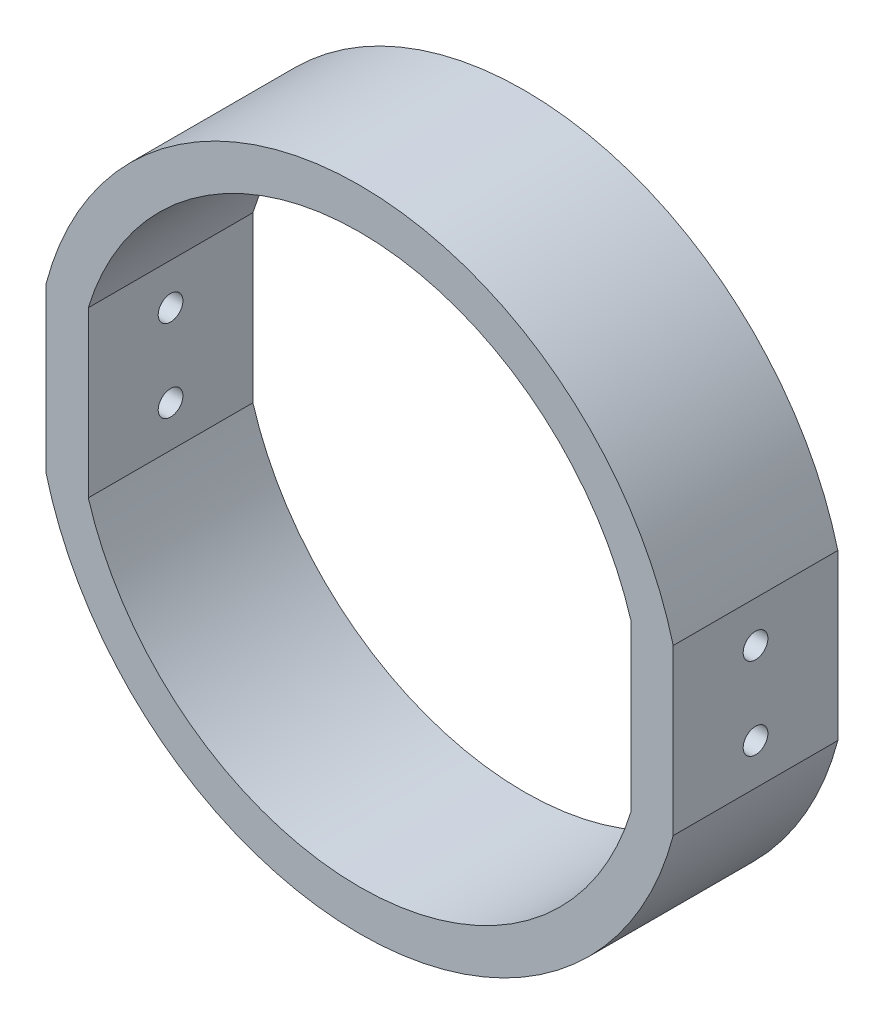
ISO-10303-21;
HEADER;
FILE_DESCRIPTION(('STEP AP214'),'2;1');
FILE_NAME('part.step','',(''),(''),'','','');
FILE_SCHEMA(('AUTOMOTIVE_DESIGN { 1 0 10303 214 1 1 1 1 }'));
ENDSEC;
DATA;
#1=APPLICATION_CONTEXT('core data for automotive mechanical design processes');
#2=APPLICATION_PROTOCOL_DEFINITION('international standard','automotive_design',2000,#1);
#3=PRODUCT_CONTEXT('',#1,'mechanical');
#4=PRODUCT('Part','Part','',(#3));
#5=PRODUCT_RELATED_PRODUCT_CATEGORY('part','',(#4));
#6=PRODUCT_DEFINITION_FORMATION('','',#4);
#7=PRODUCT_DEFINITION_CONTEXT('part definition',#1,'design');
#8=PRODUCT_DEFINITION('design','',#6,#7);
#9=PRODUCT_DEFINITION_SHAPE('','',#8);
#10=(LENGTH_UNIT() NAMED_UNIT(*) SI_UNIT(.MILLI.,.METRE.));
#11=(NAMED_UNIT(*) PLANE_ANGLE_UNIT() SI_UNIT($,.RADIAN.));
#12=(NAMED_UNIT(*) SI_UNIT($,.STERADIAN.) SOLID_ANGLE_UNIT());
#13=UNCERTAINTY_MEASURE_WITH_UNIT(LENGTH_MEASURE(1.E-05),#10,'distance_accuracy_value','');
#14=(GEOMETRIC_REPRESENTATION_CONTEXT(3) GLOBAL_UNCERTAINTY_ASSIGNED_CONTEXT((#13)) GLOBAL_UNIT_ASSIGNED_CONTEXT((#10,
#11,#12)) REPRESENTATION_CONTEXT('',''));
#15=CARTESIAN_POINT('',(0.,0.,0.));
#16=DIRECTION('',(0.,0.,1.));
#17=DIRECTION('',(1.,0.,0.));
#18=AXIS2_PLACEMENT_3D('',#15,#16,#17);
#19=CARTESIAN_POINT('',(0.,0.,20.));
#20=DIRECTION('',(0.,0.,1.));
#21=DIRECTION('',(1.,0.,0.));
#22=AXIS2_PLACEMENT_3D('',#19,#20,#21);
#23=PLANE('',#22);
#24=CARTESIAN_POINT('',(0.,0.,20.));
#25=DIRECTION('',(0.,0.,1.));
#26=DIRECTION('',(1.,0.,0.));
#27=AXIS2_PLACEMENT_3D('',#24,#25,#26);
#28=CIRCLE('',#27,39.3817822115917);
#29=CARTESIAN_POINT('',(38.0910064209551,10.,20.));
#30=VERTEX_POINT('',#29);
#31=CARTESIAN_POINT('',(-38.0910064209551,10.,20.));
#32=VERTEX_POINT('',#31);
#33=EDGE_CURVE('E150',#30,#32,#28,.T.);
#34=ORIENTED_EDGE('',*,*,#33,.T.);
#35=DIRECTION('',(0.,-1.,0.));
#36=VECTOR('',#35,1.);
#37=CARTESIAN_POINT('',(-38.0910064209551,10.,20.));
#38=LINE('',#37,#36);
#39=CARTESIAN_POINT('',(-38.0910064209551,-9.99999999999999,20.));
#40=VERTEX_POINT('',#39);
#41=EDGE_CURVE('E153',#32,#40,#38,.T.);
#42=ORIENTED_EDGE('',*,*,#41,.T.);
#43=CARTESIAN_POINT('',(0.,0.,20.));
#44=DIRECTION('',(0.,0.,1.));
#45=DIRECTION('',(1.,0.,0.));
#46=AXIS2_PLACEMENT_3D('',#43,#44,#45);
#47=CIRCLE('',#46,39.3817822115917);
#48=CARTESIAN_POINT('',(38.0910064209551,-9.99999999999996,20.));
#49=VERTEX_POINT('',#48);
#50=EDGE_CURVE('E156',#40,#49,#47,.T.);
#51=ORIENTED_EDGE('',*,*,#50,.T.);
#52=DIRECTION('',(0.,1.,0.));
#53=VECTOR('',#52,1.);
#54=CARTESIAN_POINT('',(38.0910064209551,10.,20.));
#55=LINE('',#54,#53);
#56=EDGE_CURVE('E158',#49,#30,#55,.T.);
#57=ORIENTED_EDGE('',*,*,#56,.T.);
#58=EDGE_LOOP('',(#34,#42,#51,#57));
#59=FACE_BOUND('',#58,.T.);
#60=DIRECTION('',(0.,-1.,0.));
#61=VECTOR('',#60,1.);
#62=CARTESIAN_POINT('',(-32.9761546750785,10.,20.));
#63=LINE('',#62,#61);
#64=CARTESIAN_POINT('',(-32.9761546750785,10.,20.));
#65=VERTEX_POINT('',#64);
#66=CARTESIAN_POINT('',(-32.9761546750785,-10.,20.));
#67=VERTEX_POINT('',#66);
#68=EDGE_CURVE('E120',#65,#67,#63,.T.);
#69=ORIENTED_EDGE('',*,*,#68,.F.);
#70=CARTESIAN_POINT('',(0.,0.,20.));
#71=DIRECTION('',(0.,0.,1.));
#72=DIRECTION('',(1.,0.,0.));
#73=AXIS2_PLACEMENT_3D('',#70,#71,#72);
#74=CIRCLE('',#73,34.4590594351427);
#75=CARTESIAN_POINT('',(32.9761546750785,10.,20.));
#76=VERTEX_POINT('',#75);
#77=EDGE_CURVE('E112',#76,#65,#74,.T.);
#78=ORIENTED_EDGE('',*,*,#77,.F.);
#79=DIRECTION('',(0.,1.,0.));
#80=VECTOR('',#79,1.);
#81=CARTESIAN_POINT('',(32.9761546750785,10.,20.));
#82=LINE('',#81,#80);
#83=CARTESIAN_POINT('',(32.9761546750785,-10.,20.));
#84=VERTEX_POINT('',#83);
#85=EDGE_CURVE('E134',#84,#76,#82,.T.);
#86=ORIENTED_EDGE('',*,*,#85,.F.);
#87=CARTESIAN_POINT('',(0.,0.,20.));
#88=DIRECTION('',(0.,0.,1.));
#89=DIRECTION('',(1.,0.,0.));
#90=AXIS2_PLACEMENT_3D('',#87,#88,#89);
#91=CIRCLE('',#90,34.4590594351427);
#92=EDGE_CURVE('E132',#67,#84,#91,.T.);
#93=ORIENTED_EDGE('',*,*,#92,.F.);
#94=EDGE_LOOP('',(#69,#78,#86,#93));
#95=FACE_BOUND('',#94,.T.);
#96=ADVANCED_FACE('F45',(#59,#95),#23,.T.);
#97=CARTESIAN_POINT('',(0.,0.,0.));
#98=DIRECTION('',(0.,0.,1.));
#99=DIRECTION('',(1.,0.,0.));
#100=AXIS2_PLACEMENT_3D('',#97,#98,#99);
#101=PLANE('',#100);
#102=CARTESIAN_POINT('',(0.,0.,0.));
#103=DIRECTION('',(0.,0.,1.));
#104=DIRECTION('',(1.,0.,0.));
#105=AXIS2_PLACEMENT_3D('',#102,#103,#104);
#106=CIRCLE('',#105,39.3817822115917);
#107=CARTESIAN_POINT('',(38.0910064209551,10.,0.));
#108=VERTEX_POINT('',#107);
#109=CARTESIAN_POINT('',(-38.0910064209551,10.,0.));
#110=VERTEX_POINT('',#109);
#111=EDGE_CURVE('E128',#108,#110,#106,.T.);
#112=ORIENTED_EDGE('',*,*,#111,.F.);
#113=DIRECTION('',(0.,1.,0.));
#114=VECTOR('',#113,1.);
#115=CARTESIAN_POINT('',(38.0910064209551,10.,0.));
#116=LINE('',#115,#114);
#117=CARTESIAN_POINT('',(38.0910064209551,-9.99999999999996,0.));
#118=VERTEX_POINT('',#117);
#119=EDGE_CURVE('E154',#118,#108,#116,.T.);
#120=ORIENTED_EDGE('',*,*,#119,.F.);
#121=CARTESIAN_POINT('',(0.,0.,0.));
#122=DIRECTION('',(0.,0.,1.));
#123=DIRECTION('',(1.,0.,0.));
#124=AXIS2_PLACEMENT_3D('',#121,#122,#123);
#125=CIRCLE('',#124,39.3817822115917);
#126=CARTESIAN_POINT('',(-38.0910064209551,-9.99999999999999,0.));
#127=VERTEX_POINT('',#126);
#128=EDGE_CURVE('E165',#127,#118,#125,.T.);
#129=ORIENTED_EDGE('',*,*,#128,.F.);
#130=DIRECTION('',(0.,-1.,0.));
#131=VECTOR('',#130,1.);
#132=CARTESIAN_POINT('',(-38.0910064209551,10.,0.));
#133=LINE('',#132,#131);
#134=EDGE_CURVE('E163',#110,#127,#133,.T.);
#135=ORIENTED_EDGE('',*,*,#134,.F.);
#136=EDGE_LOOP('',(#112,#120,#129,#135));
#137=FACE_BOUND('',#136,.T.);
#138=CARTESIAN_POINT('',(0.,0.,0.));
#139=DIRECTION('',(0.,0.,1.));
#140=DIRECTION('',(1.,0.,0.));
#141=AXIS2_PLACEMENT_3D('',#138,#139,#140);
#142=CIRCLE('',#141,34.4590594351427);
#143=CARTESIAN_POINT('',(32.9761546750785,10.,0.));
#144=VERTEX_POINT('',#143);
#145=CARTESIAN_POINT('',(-32.9761546750785,10.,0.));
#146=VERTEX_POINT('',#145);
#147=EDGE_CURVE('E70',#144,#146,#142,.T.);
#148=ORIENTED_EDGE('',*,*,#147,.T.);
#149=DIRECTION('',(0.,-1.,0.));
#150=VECTOR('',#149,1.);
#151=CARTESIAN_POINT('',(-32.9761546750785,10.,0.));
#152=LINE('',#151,#150);
#153=CARTESIAN_POINT('',(-32.9761546750785,-10.,0.));
#154=VERTEX_POINT('',#153);
#155=EDGE_CURVE('E127',#146,#154,#152,.T.);
#156=ORIENTED_EDGE('',*,*,#155,.T.);
#157=CARTESIAN_POINT('',(0.,0.,0.));
#158=DIRECTION('',(0.,0.,1.));
#159=DIRECTION('',(1.,0.,0.));
#160=AXIS2_PLACEMENT_3D('',#157,#158,#159);
#161=CIRCLE('',#160,34.4590594351427);
#162=CARTESIAN_POINT('',(32.9761546750785,-10.,0.));
#163=VERTEX_POINT('',#162);
#164=EDGE_CURVE('E142',#154,#163,#161,.T.);
#165=ORIENTED_EDGE('',*,*,#164,.T.);
#166=DIRECTION('',(0.,1.,0.));
#167=VECTOR('',#166,1.);
#168=CARTESIAN_POINT('',(32.9761546750785,10.,0.));
#169=LINE('',#168,#167);
#170=EDGE_CURVE('E121',#163,#144,#169,.T.);
#171=ORIENTED_EDGE('',*,*,#170,.T.);
#172=EDGE_LOOP('',(#148,#156,#165,#171));
#173=FACE_BOUND('',#172,.T.);
#174=ADVANCED_FACE('F212',(#137,#173),#101,.F.);
#175=CARTESIAN_POINT('',(0.,0.,20.));
#176=DIRECTION('',(0.,0.,-1.));
#177=DIRECTION('',(-1.,0.,0.));
#178=AXIS2_PLACEMENT_3D('',#175,#176,#177);
#179=CYLINDRICAL_SURFACE('',#178,39.3817822115917);
#180=ORIENTED_EDGE('',*,*,#111,.T.);
#181=DIRECTION('',(0.,0.,-1.));
#182=VECTOR('',#181,1.);
#183=CARTESIAN_POINT('',(-38.0910064209551,10.,20.));
#184=LINE('',#183,#182);
#185=EDGE_CURVE('E13',#32,#110,#184,.T.);
#186=ORIENTED_EDGE('',*,*,#185,.F.);
#187=ORIENTED_EDGE('',*,*,#33,.F.);
#188=DIRECTION('',(0.,0.,-1.));
#189=VECTOR('',#188,1.);
#190=CARTESIAN_POINT('',(38.0910064209551,10.,20.));
#191=LINE('',#190,#189);
#192=EDGE_CURVE('E160',#30,#108,#191,.T.);
#193=ORIENTED_EDGE('',*,*,#192,.T.);
#194=EDGE_LOOP('',(#180,#186,#187,#193));
#195=FACE_BOUND('',#194,.T.);
#196=ADVANCED_FACE('F47',(#195),#179,.T.);
#197=CARTESIAN_POINT('',(-38.0910064209551,10.,20.));
#198=DIRECTION('',(1.,0.,0.));
#199=DIRECTION('',(0.,0.,-1.));
#200=AXIS2_PLACEMENT_3D('',#197,#198,#199);
#201=PLANE('',#200);
#202=CARTESIAN_POINT('',(-38.0910064209551,-4.99999999999998,10.));
#203=DIRECTION('',(1.,0.,0.));
#204=DIRECTION('',(0.,0.,1.));
#205=AXIS2_PLACEMENT_3D('',#202,#203,#204);
#206=CIRCLE('',#205,1.5);
#207=CARTESIAN_POINT('',(-38.0910064209551,-4.99999999999998,11.5));
#208=VERTEX_POINT('',#207);
#209=EDGE_CURVE('E194',#208,#208,#206,.T.);
#210=ORIENTED_EDGE('',*,*,#209,.T.);
#211=EDGE_LOOP('',(#210));
#212=FACE_BOUND('',#211,.T.);
#213=CARTESIAN_POINT('',(-38.0910064209551,5.,10.));
#214=DIRECTION('',(1.,0.,0.));
#215=DIRECTION('',(0.,0.,-1.));
#216=AXIS2_PLACEMENT_3D('',#213,#214,#215);
#217=CIRCLE('',#216,1.5);
#218=CARTESIAN_POINT('',(-38.0910064209551,5.,8.5));
#219=VERTEX_POINT('',#218);
#220=EDGE_CURVE('E176',#219,#219,#217,.T.);
#221=ORIENTED_EDGE('',*,*,#220,.T.);
#222=EDGE_LOOP('',(#221));
#223=FACE_BOUND('',#222,.T.);
#224=ORIENTED_EDGE('',*,*,#134,.T.);
#225=DIRECTION('',(0.,0.,-1.));
#226=VECTOR('',#225,1.);
#227=CARTESIAN_POINT('',(-38.0910064209551,-9.99999999999999,20.));
#228=LINE('',#227,#226);
#229=EDGE_CURVE('E54',#40,#127,#228,.T.);
#230=ORIENTED_EDGE('',*,*,#229,.F.);
#231=ORIENTED_EDGE('',*,*,#41,.F.);
#232=ORIENTED_EDGE('',*,*,#185,.T.);
#233=EDGE_LOOP('',(#224,#230,#231,#232));
#234=FACE_BOUND('',#233,.T.);
#235=ADVANCED_FACE('F237',(#212,#223,#234),#201,.F.);
#236=CARTESIAN_POINT('',(0.,0.,20.));
#237=DIRECTION('',(0.,0.,-1.));
#238=DIRECTION('',(-1.,0.,0.));
#239=AXIS2_PLACEMENT_3D('',#236,#237,#238);
#240=CYLINDRICAL_SURFACE('',#239,39.3817822115917);
#241=ORIENTED_EDGE('',*,*,#128,.T.);
#242=DIRECTION('',(0.,0.,-1.));
#243=VECTOR('',#242,1.);
#244=CARTESIAN_POINT('',(38.0910064209551,-9.99999999999996,20.));
#245=LINE('',#244,#243);
#246=EDGE_CURVE('E170',#49,#118,#245,.T.);
#247=ORIENTED_EDGE('',*,*,#246,.F.);
#248=ORIENTED_EDGE('',*,*,#50,.F.);
#249=ORIENTED_EDGE('',*,*,#229,.T.);
#250=EDGE_LOOP('',(#241,#247,#248,#249));
#251=FACE_BOUND('',#250,.T.);
#252=ADVANCED_FACE('F234',(#251),#240,.T.);
#253=CARTESIAN_POINT('',(38.0910064209551,10.,20.));
#254=DIRECTION('',(-1.,0.,0.));
#255=DIRECTION('',(0.,0.,1.));
#256=AXIS2_PLACEMENT_3D('',#253,#254,#255);
#257=PLANE('',#256);
#258=CARTESIAN_POINT('',(38.0910064209551,-4.99999999999998,10.));
#259=DIRECTION('',(1.,0.,0.));
#260=DIRECTION('',(0.,0.,1.));
#261=AXIS2_PLACEMENT_3D('',#258,#259,#260);
#262=CIRCLE('',#261,1.5);
#263=CARTESIAN_POINT('',(38.0910064209551,-4.99999999999998,11.5));
#264=VERTEX_POINT('',#263);
#265=EDGE_CURVE('E191',#264,#264,#262,.T.);
#266=ORIENTED_EDGE('',*,*,#265,.F.);
#267=EDGE_LOOP('',(#266));
#268=FACE_BOUND('',#267,.T.);
#269=CARTESIAN_POINT('',(38.0910064209551,5.,10.));
#270=DIRECTION('',(1.,0.,0.));
#271=DIRECTION('',(0.,0.,-1.));
#272=AXIS2_PLACEMENT_3D('',#269,#270,#271);
#273=CIRCLE('',#272,1.5);
#274=CARTESIAN_POINT('',(38.0910064209551,5.,8.5));
#275=VERTEX_POINT('',#274);
#276=EDGE_CURVE('E181',#275,#275,#273,.T.);
#277=ORIENTED_EDGE('',*,*,#276,.F.);
#278=EDGE_LOOP('',(#277));
#279=FACE_BOUND('',#278,.T.);
#280=ORIENTED_EDGE('',*,*,#119,.T.);
#281=ORIENTED_EDGE('',*,*,#192,.F.);
#282=ORIENTED_EDGE('',*,*,#56,.F.);
#283=ORIENTED_EDGE('',*,*,#246,.T.);
#284=EDGE_LOOP('',(#280,#281,#282,#283));
#285=FACE_BOUND('',#284,.T.);
#286=ADVANCED_FACE('F231',(#268,#279,#285),#257,.F.);
#287=CARTESIAN_POINT('',(0.,0.,20.));
#288=DIRECTION('',(0.,0.,-1.));
#289=DIRECTION('',(-1.,0.,0.));
#290=AXIS2_PLACEMENT_3D('',#287,#288,#289);
#291=CYLINDRICAL_SURFACE('',#290,34.4590594351427);
#292=ORIENTED_EDGE('',*,*,#147,.F.);
#293=DIRECTION('',(0.,0.,-1.));
#294=VECTOR('',#293,1.);
#295=CARTESIAN_POINT('',(32.9761546750785,10.,20.));
#296=LINE('',#295,#294);
#297=EDGE_CURVE('E116',#76,#144,#296,.T.);
#298=ORIENTED_EDGE('',*,*,#297,.F.);
#299=ORIENTED_EDGE('',*,*,#77,.T.);
#300=DIRECTION('',(0.,0.,-1.));
#301=VECTOR('',#300,1.);
#302=CARTESIAN_POINT('',(-32.9761546750785,10.,20.));
#303=LINE('',#302,#301);
#304=EDGE_CURVE('E115',#65,#146,#303,.T.);
#305=ORIENTED_EDGE('',*,*,#304,.T.);
#306=EDGE_LOOP('',(#292,#298,#299,#305));
#307=FACE_BOUND('',#306,.T.);
#308=ADVANCED_FACE('F114',(#307),#291,.F.);
#309=CARTESIAN_POINT('',(-32.9761546750785,10.,20.));
#310=DIRECTION('',(1.,0.,0.));
#311=DIRECTION('',(0.,0.,-1.));
#312=AXIS2_PLACEMENT_3D('',#309,#310,#311);
#313=PLANE('',#312);
#314=CARTESIAN_POINT('',(-32.9761546750785,-4.99999999999998,10.));
#315=DIRECTION('',(1.,0.,0.));
#316=DIRECTION('',(0.,0.,-1.));
#317=AXIS2_PLACEMENT_3D('',#314,#315,#316);
#318=CIRCLE('',#317,1.5);
#319=CARTESIAN_POINT('',(-32.9761546750785,-4.99999999999998,8.50000000000001));
#320=VERTEX_POINT('',#319);
#321=EDGE_CURVE('E186',#320,#320,#318,.T.);
#322=ORIENTED_EDGE('',*,*,#321,.F.);
#323=EDGE_LOOP('',(#322));
#324=FACE_BOUND('',#323,.T.);
#325=CARTESIAN_POINT('',(-32.9761546750785,5.,10.));
#326=DIRECTION('',(1.,0.,0.));
#327=DIRECTION('',(0.,0.,-1.));
#328=AXIS2_PLACEMENT_3D('',#325,#326,#327);
#329=CIRCLE('',#328,1.5);
#330=CARTESIAN_POINT('',(-32.9761546750785,5.,8.5));
#331=VERTEX_POINT('',#330);
#332=EDGE_CURVE('E140',#331,#331,#329,.T.);
#333=ORIENTED_EDGE('',*,*,#332,.F.);
#334=EDGE_LOOP('',(#333));
#335=FACE_BOUND('',#334,.T.);
#336=ORIENTED_EDGE('',*,*,#155,.F.);
#337=ORIENTED_EDGE('',*,*,#304,.F.);
#338=ORIENTED_EDGE('',*,*,#68,.T.);
#339=DIRECTION('',(0.,0.,-1.));
#340=VECTOR('',#339,1.);
#341=CARTESIAN_POINT('',(-32.9761546750785,-10.,20.));
#342=LINE('',#341,#340);
#343=EDGE_CURVE('E129',#67,#154,#342,.T.);
#344=ORIENTED_EDGE('',*,*,#343,.T.);
#345=EDGE_LOOP('',(#336,#337,#338,#344));
#346=FACE_BOUND('',#345,.T.);
#347=ADVANCED_FACE('F124',(#324,#335,#346),#313,.T.);
#348=CARTESIAN_POINT('',(0.,0.,20.));
#349=DIRECTION('',(0.,0.,-1.));
#350=DIRECTION('',(-1.,0.,0.));
#351=AXIS2_PLACEMENT_3D('',#348,#349,#350);
#352=CYLINDRICAL_SURFACE('',#351,34.4590594351427);
#353=ORIENTED_EDGE('',*,*,#164,.F.);
#354=ORIENTED_EDGE('',*,*,#343,.F.);
#355=ORIENTED_EDGE('',*,*,#92,.T.);
#356=DIRECTION('',(0.,0.,-1.));
#357=VECTOR('',#356,1.);
#358=CARTESIAN_POINT('',(32.9761546750785,-10.,20.));
#359=LINE('',#358,#357);
#360=EDGE_CURVE('E62',#84,#163,#359,.T.);
#361=ORIENTED_EDGE('',*,*,#360,.T.);
#362=EDGE_LOOP('',(#353,#354,#355,#361));
#363=FACE_BOUND('',#362,.T.);
#364=ADVANCED_FACE('F208',(#363),#352,.F.);
#365=CARTESIAN_POINT('',(32.9761546750785,10.,20.));
#366=DIRECTION('',(-1.,0.,0.));
#367=DIRECTION('',(0.,0.,1.));
#368=AXIS2_PLACEMENT_3D('',#365,#366,#367);
#369=PLANE('',#368);
#370=CARTESIAN_POINT('',(32.9761546750785,-4.99999999999998,10.));
#371=DIRECTION('',(-1.,0.,0.));
#372=DIRECTION('',(0.,0.,1.));
#373=AXIS2_PLACEMENT_3D('',#370,#371,#372);
#374=CIRCLE('',#373,1.5);
#375=CARTESIAN_POINT('',(32.9761546750785,-4.99999999999998,11.5));
#376=VERTEX_POINT('',#375);
#377=EDGE_CURVE('E49',#376,#376,#374,.T.);
#378=ORIENTED_EDGE('',*,*,#377,.F.);
#379=EDGE_LOOP('',(#378));
#380=FACE_BOUND('',#379,.T.);
#381=CARTESIAN_POINT('',(32.9761546750785,5.,10.));
#382=DIRECTION('',(-1.,0.,0.));
#383=DIRECTION('',(0.,0.,1.));
#384=AXIS2_PLACEMENT_3D('',#381,#382,#383);
#385=CIRCLE('',#384,1.5);
#386=CARTESIAN_POINT('',(32.9761546750785,5.,11.5));
#387=VERTEX_POINT('',#386);
#388=EDGE_CURVE('E174',#387,#387,#385,.T.);
#389=ORIENTED_EDGE('',*,*,#388,.F.);
#390=EDGE_LOOP('',(#389));
#391=FACE_BOUND('',#390,.T.);
#392=ORIENTED_EDGE('',*,*,#170,.F.);
#393=ORIENTED_EDGE('',*,*,#360,.F.);
#394=ORIENTED_EDGE('',*,*,#85,.T.);
#395=ORIENTED_EDGE('',*,*,#297,.T.);
#396=EDGE_LOOP('',(#392,#393,#394,#395));
#397=FACE_BOUND('',#396,.T.);
#398=ADVANCED_FACE('F204',(#380,#391,#397),#369,.T.);
#399=CARTESIAN_POINT('',(-38.0910064209551,5.,10.));
#400=DIRECTION('',(1.,0.,0.));
#401=DIRECTION('',(0.,0.,-1.));
#402=AXIS2_PLACEMENT_3D('',#399,#400,#401);
#403=CYLINDRICAL_SURFACE('',#402,1.5);
#404=ORIENTED_EDGE('',*,*,#388,.T.);
#405=EDGE_LOOP('',(#404));
#406=FACE_BOUND('',#405,.T.);
#407=ORIENTED_EDGE('',*,*,#276,.T.);
#408=EDGE_LOOP('',(#407));
#409=FACE_BOUND('',#408,.T.);
#410=ADVANCED_FACE('F207',(#406,#409),#403,.F.);
#411=ORIENTED_EDGE('',*,*,#332,.T.);
#412=EDGE_LOOP('',(#411));
#413=FACE_BOUND('',#412,.T.);
#414=ORIENTED_EDGE('',*,*,#220,.F.);
#415=EDGE_LOOP('',(#414));
#416=FACE_BOUND('',#415,.T.);
#417=ADVANCED_FACE('F312',(#413,#416),#403,.F.);
#418=CARTESIAN_POINT('',(-38.0910064209551,-4.99999999999998,10.));
#419=DIRECTION('',(1.,0.,0.));
#420=DIRECTION('',(0.,0.,-1.));
#421=AXIS2_PLACEMENT_3D('',#418,#419,#420);
#422=CYLINDRICAL_SURFACE('',#421,1.5);
#423=ORIENTED_EDGE('',*,*,#377,.T.);
#424=EDGE_LOOP('',(#423));
#425=FACE_BOUND('',#424,.T.);
#426=ORIENTED_EDGE('',*,*,#265,.T.);
#427=EDGE_LOOP('',(#426));
#428=FACE_BOUND('',#427,.T.);
#429=ADVANCED_FACE('F201',(#425,#428),#422,.F.);
#430=ORIENTED_EDGE('',*,*,#321,.T.);
#431=EDGE_LOOP('',(#430));
#432=FACE_BOUND('',#431,.T.);
#433=ORIENTED_EDGE('',*,*,#209,.F.);
#434=EDGE_LOOP('',(#433));
#435=FACE_BOUND('',#434,.T.);
#436=ADVANCED_FACE('F327',(#432,#435),#422,.F.);
#437=CLOSED_SHELL('',(#96,#174,#196,#235,#252,#286,#308,#347,#364,#398,#410,#417,#429,#436));
#438=MANIFOLD_SOLID_BREP('B2',#437);
#439=ADVANCED_BREP_SHAPE_REPRESENTATION('',(#18,#438),#14);
#440=SHAPE_DEFINITION_REPRESENTATION(#9,#439);
ENDSEC;
END-ISO-10303-21;
